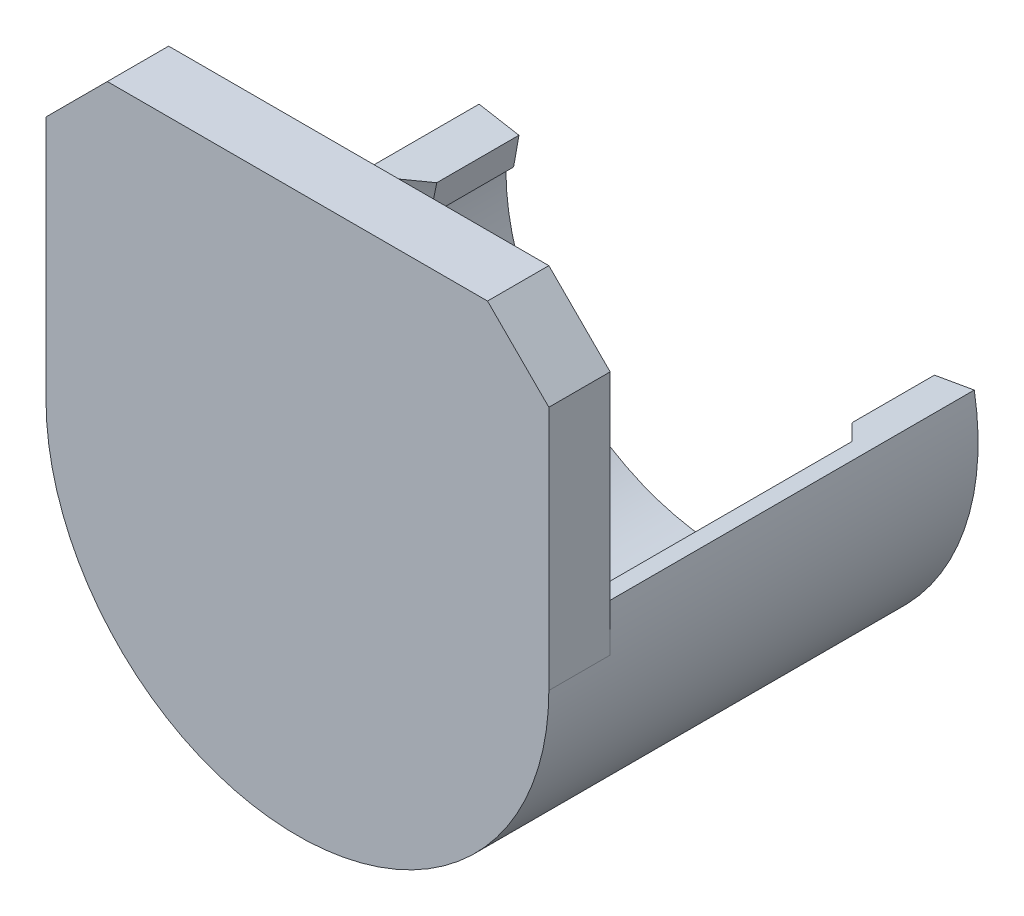
ISO-10303-21;
HEADER;
FILE_DESCRIPTION(('STEP AP214'),'2;1');
FILE_NAME('part.step','',(''),(''),'','','');
FILE_SCHEMA(('AUTOMOTIVE_DESIGN { 1 0 10303 214 1 1 1 1 }'));
ENDSEC;
DATA;
#1=APPLICATION_CONTEXT('core data for automotive mechanical design processes');
#2=APPLICATION_PROTOCOL_DEFINITION('international standard','automotive_design',2000,#1);
#3=PRODUCT_CONTEXT('',#1,'mechanical');
#4=PRODUCT('Part','Part','',(#3));
#5=PRODUCT_RELATED_PRODUCT_CATEGORY('part','',(#4));
#6=PRODUCT_DEFINITION_FORMATION('','',#4);
#7=PRODUCT_DEFINITION_CONTEXT('part definition',#1,'design');
#8=PRODUCT_DEFINITION('design','',#6,#7);
#9=PRODUCT_DEFINITION_SHAPE('','',#8);
#10=(LENGTH_UNIT() NAMED_UNIT(*) SI_UNIT(.MILLI.,.METRE.));
#11=(NAMED_UNIT(*) PLANE_ANGLE_UNIT() SI_UNIT($,.RADIAN.));
#12=(NAMED_UNIT(*) SI_UNIT($,.STERADIAN.) SOLID_ANGLE_UNIT());
#13=UNCERTAINTY_MEASURE_WITH_UNIT(LENGTH_MEASURE(1.E-05),#10,'distance_accuracy_value','');
#14=(GEOMETRIC_REPRESENTATION_CONTEXT(3) GLOBAL_UNCERTAINTY_ASSIGNED_CONTEXT((#13)) GLOBAL_UNIT_ASSIGNED_CONTEXT((#10,
#11,#12)) REPRESENTATION_CONTEXT('',''));
#15=CARTESIAN_POINT('',(0.,0.,0.));
#16=DIRECTION('',(0.,0.,1.));
#17=DIRECTION('',(1.,0.,0.));
#18=AXIS2_PLACEMENT_3D('',#15,#16,#17);
#19=CARTESIAN_POINT('',(10.7560702783993,1.89658539647825,19.05));
#20=DIRECTION('',(0.984807753012207,0.173648177666934,0.));
#21=DIRECTION('',(-0.173648177666934,0.984807753012208,0.));
#22=AXIS2_PLACEMENT_3D('',#19,#20,#21);
#23=PLANE('',#22);
#24=DIRECTION('',(0.,0.,-1.));
#25=VECTOR('',#24,1.);
#26=CARTESIAN_POINT('',(11.0317367604456,0.333203088571373,19.05));
#27=LINE('',#26,#25);
#28=CARTESIAN_POINT('',(11.0317367604456,0.333203088571373,4.36926765407338));
#29=VERTEX_POINT('',#28);
#30=CARTESIAN_POINT('',(11.0317367604456,0.333203088571373,0.));
#31=VERTEX_POINT('',#30);
#32=EDGE_CURVE('E260',#29,#31,#27,.T.);
#33=ORIENTED_EDGE('',*,*,#32,.F.);
#34=CARTESIAN_POINT('',(11.0317367604456,0.333203088571373,4.36926765407338));
#35=CARTESIAN_POINT('',(11.0067573643105,0.474868283737129,4.34856687302384));
#36=CARTESIAN_POINT('',(10.9817087452963,0.616926061359059,4.3305819865409));
#37=CARTESIAN_POINT('',(10.9315450401648,0.901418570275759,4.30021100365753));
#38=CARTESIAN_POINT('',(10.9064300966001,1.04385249311502,4.2878170878302));
#39=CARTESIAN_POINT('',(10.8604560572541,1.30458422663245,4.27037533049476));
#40=CARTESIAN_POINT('',(10.8396071360627,1.42282433434397,4.26443120353665));
#41=CARTESIAN_POINT('',(10.7978623891178,1.65957055875689,4.25648894768613));
#42=CARTESIAN_POINT('',(10.7769665370146,1.77807682489528,4.25449541758792));
#43=CARTESIAN_POINT('',(10.7560702783993,1.89658539647825,4.25450000000002));
#44=B_SPLINE_CURVE_WITH_KNOTS('',3,(#34,#35,#36,#37,#38,#39,#40,#41,#42,#43),.UNSPECIFIED.,.F.,
.F.,(4,2,2,2,4),(0.,0.435984229437677,0.871356794531492,1.23192681347748,1.59291631727818),.UNSPECIFIED.);
#45=CARTESIAN_POINT('',(10.7560702783993,1.89658539647825,4.25450000000002));
#46=VERTEX_POINT('',#45);
#47=EDGE_CURVE('E267',#29,#46,#44,.T.);
#48=ORIENTED_EDGE('',*,*,#47,.T.);
#49=DIRECTION('',(0.,0.,-1.));
#50=VECTOR('',#49,1.);
#51=CARTESIAN_POINT('',(10.7560702783993,1.89658539647825,19.05));
#52=LINE('',#51,#50);
#53=CARTESIAN_POINT('',(10.7560702783993,1.89658539647825,0.));
#54=VERTEX_POINT('',#53);
#55=EDGE_CURVE('E224',#46,#54,#52,.T.);
#56=ORIENTED_EDGE('',*,*,#55,.T.);
#57=DIRECTION('',(0.173648177666934,-0.984807753012207,0.));
#58=VECTOR('',#57,1.);
#59=CARTESIAN_POINT('',(10.7560702783993,1.89658539647825,0.));
#60=LINE('',#59,#58);
#61=EDGE_CURVE('E214',#54,#31,#60,.T.);
#62=ORIENTED_EDGE('',*,*,#61,.T.);
#63=EDGE_LOOP('',(#33,#48,#56,#62));
#64=FACE_BOUND('',#63,.T.);
#65=ADVANCED_FACE('F39',(#64),#23,.F.);
#66=CARTESIAN_POINT('',(11.0317367604456,0.333203088571373,19.05));
#67=DIRECTION('',(0.641680062040874,0.766972423219518,0.));
#68=DIRECTION('',(-0.766972423219518,0.641680062040874,0.));
#69=AXIS2_PLACEMENT_3D('',#66,#67,#68);
#70=PLANE('',#69);
#71=DIRECTION('',(0.,0.,-1.));
#72=VECTOR('',#71,1.);
#73=CARTESIAN_POINT('',(11.43,0.,19.05));
#74=LINE('',#73,#72);
#75=CARTESIAN_POINT('',(11.43,0.,4.76250000000001));
#76=VERTEX_POINT('',#75);
#77=CARTESIAN_POINT('',(11.43,0.,0.));
#78=VERTEX_POINT('',#77);
#79=EDGE_CURVE('E258',#76,#78,#74,.T.);
#80=ORIENTED_EDGE('',*,*,#79,.F.);
#81=CARTESIAN_POINT('',(11.43,0.,4.76250000000001));
#82=CARTESIAN_POINT('',(11.3639377327988,0.0552703570986266,4.69641907041151));
#83=CARTESIAN_POINT('',(11.2977180016301,0.110672454903276,4.63060924903913));
#84=CARTESIAN_POINT('',(11.1649635885535,0.221740151003241,4.49953180021064));
#85=CARTESIAN_POINT('',(11.0984289065374,0.277405749389076,4.43426417294081));
#86=CARTESIAN_POINT('',(11.0317367604456,0.333203088571374,4.36926765407338));
#87=B_SPLINE_CURVE_WITH_KNOTS('',3,(#81,#82,#83,#84,#85,#86),.UNSPECIFIED.,.F.,.F.,(4,2,4),(0.,
0.325681440116724,0.651362992122073),.UNSPECIFIED.);
#88=EDGE_CURVE('E292',#76,#29,#87,.T.);
#89=ORIENTED_EDGE('',*,*,#88,.T.);
#90=ORIENTED_EDGE('',*,*,#32,.T.);
#91=DIRECTION('',(0.766972423219518,-0.641680062040874,0.));
#92=VECTOR('',#91,1.);
#93=CARTESIAN_POINT('',(11.0317367604456,0.333203088571373,0.));
#94=LINE('',#93,#92);
#95=EDGE_CURVE('E227',#31,#78,#94,.T.);
#96=ORIENTED_EDGE('',*,*,#95,.T.);
#97=EDGE_LOOP('',(#80,#89,#90,#96));
#98=FACE_BOUND('',#97,.T.);
#99=ADVANCED_FACE('F306',(#98),#70,.F.);
#100=CARTESIAN_POINT('',(-11.0317367604456,0.333203088571373,19.05));
#101=DIRECTION('',(-0.641680062040875,0.766972423219518,0.));
#102=DIRECTION('',(-0.766972423219518,-0.641680062040875,0.));
#103=AXIS2_PLACEMENT_3D('',#100,#101,#102);
#104=PLANE('',#103);
#105=DIRECTION('',(0.,0.,-1.));
#106=VECTOR('',#105,1.);
#107=CARTESIAN_POINT('',(-11.0317367604456,0.333203088571373,19.05));
#108=LINE('',#107,#106);
#109=CARTESIAN_POINT('',(-11.0317367604456,0.333203088571373,4.36926765407338));
#110=VERTEX_POINT('',#109);
#111=CARTESIAN_POINT('',(-11.0317367604456,0.333203088571373,0.));
#112=VERTEX_POINT('',#111);
#113=EDGE_CURVE('E254',#110,#112,#108,.T.);
#114=ORIENTED_EDGE('',*,*,#113,.F.);
#115=CARTESIAN_POINT('',(-11.0317367604456,0.333203088571373,4.36926765407338));
#116=CARTESIAN_POINT('',(-11.0984289065374,0.277405749389076,4.43426417294081));
#117=CARTESIAN_POINT('',(-11.1649635885535,0.22174015100324,4.49953180021064));
#118=CARTESIAN_POINT('',(-11.2977180016301,0.110672454903276,4.63060924903913));
#119=CARTESIAN_POINT('',(-11.3639377327988,0.0552703570986273,4.69641907041151));
#120=CARTESIAN_POINT('',(-11.43,0.,4.76250000000001));
#121=B_SPLINE_CURVE_WITH_KNOTS('',3,(#115,#116,#117,#118,#119,#120),.UNSPECIFIED.,.F.,.F.,(4,2,
4),(0.,0.325681552005347,0.651362992122069),.UNSPECIFIED.);
#122=CARTESIAN_POINT('',(-11.43,0.,4.76250000000001));
#123=VERTEX_POINT('',#122);
#124=EDGE_CURVE('E323',#110,#123,#121,.T.);
#125=ORIENTED_EDGE('',*,*,#124,.T.);
#126=DIRECTION('',(0.,0.,-1.));
#127=VECTOR('',#126,1.);
#128=CARTESIAN_POINT('',(-11.43,0.,19.05));
#129=LINE('',#128,#127);
#130=CARTESIAN_POINT('',(-11.43,0.,0.));
#131=VERTEX_POINT('',#130);
#132=EDGE_CURVE('E256',#123,#131,#129,.T.);
#133=ORIENTED_EDGE('',*,*,#132,.T.);
#134=DIRECTION('',(0.766972423219518,0.641680062040875,0.));
#135=VECTOR('',#134,1.);
#136=CARTESIAN_POINT('',(-11.0317367604456,0.333203088571373,0.));
#137=LINE('',#136,#135);
#138=EDGE_CURVE('E233',#131,#112,#137,.T.);
#139=ORIENTED_EDGE('',*,*,#138,.T.);
#140=EDGE_LOOP('',(#114,#125,#133,#139));
#141=FACE_BOUND('',#140,.T.);
#142=ADVANCED_FACE('F310',(#141),#104,.F.);
#143=CARTESIAN_POINT('',(-10.7560702783993,1.89658539647825,19.05));
#144=DIRECTION('',(-0.984807753012207,0.173648177666934,0.));
#145=DIRECTION('',(-0.173648177666934,-0.984807753012208,0.));
#146=AXIS2_PLACEMENT_3D('',#143,#144,#145);
#147=PLANE('',#146);
#148=DIRECTION('',(0.,0.,-1.));
#149=VECTOR('',#148,1.);
#150=CARTESIAN_POINT('',(-10.7560702783993,1.89658539647825,19.05));
#151=LINE('',#150,#149);
#152=CARTESIAN_POINT('',(-10.7560702783993,1.89658539647825,4.25450000000002));
#153=VERTEX_POINT('',#152);
#154=CARTESIAN_POINT('',(-10.7560702783993,1.89658539647825,0.));
#155=VERTEX_POINT('',#154);
#156=EDGE_CURVE('E252',#153,#155,#151,.T.);
#157=ORIENTED_EDGE('',*,*,#156,.F.);
#158=CARTESIAN_POINT('',(-10.7560702783993,1.89658539647825,4.25450000000002));
#159=CARTESIAN_POINT('',(-10.7769665370146,1.77807682489528,4.25449541758792));
#160=CARTESIAN_POINT('',(-10.7978623891178,1.65957055875689,4.25648894768613));
#161=CARTESIAN_POINT('',(-10.8396071360627,1.42282433434397,4.26443120353665));
#162=CARTESIAN_POINT('',(-10.8604560572541,1.30458422663245,4.27037533049476));
#163=CARTESIAN_POINT('',(-10.9064300966001,1.04385249311502,4.2878170878302));
#164=CARTESIAN_POINT('',(-10.9315450401648,0.901418570275759,4.30021100365753));
#165=CARTESIAN_POINT('',(-10.9817087452963,0.61692606135906,4.3305819865409));
#166=CARTESIAN_POINT('',(-11.0067573643105,0.47486828373713,4.34856687302384));
#167=CARTESIAN_POINT('',(-11.0317367604456,0.333203088571373,4.36926765407338));
#168=B_SPLINE_CURVE_WITH_KNOTS('',3,(#158,#159,#160,#161,#162,#163,#164,#165,#166,#167),
.UNSPECIFIED.,.F.,.F.,(4,2,2,2,4),(0.,0.360989503800705,0.721559522746688,1.1569320878405,
1.59291631727818),.UNSPECIFIED.);
#169=EDGE_CURVE('E299',#153,#110,#168,.T.);
#170=ORIENTED_EDGE('',*,*,#169,.T.);
#171=ORIENTED_EDGE('',*,*,#113,.T.);
#172=DIRECTION('',(0.173648177666934,0.984807753012207,0.));
#173=VECTOR('',#172,1.);
#174=CARTESIAN_POINT('',(-10.7560702783993,1.89658539647825,0.));
#175=LINE('',#174,#173);
#176=EDGE_CURVE('E236',#112,#155,#175,.T.);
#177=ORIENTED_EDGE('',*,*,#176,.T.);
#178=EDGE_LOOP('',(#157,#170,#171,#177));
#179=FACE_BOUND('',#178,.T.);
#180=ADVANCED_FACE('F319',(#179),#147,.F.);
#181=CARTESIAN_POINT('',(-11.2563526169295,1.98479867073305,19.05));
#182=DIRECTION('',(-0.173648177666934,-0.984807753012207,0.));
#183=DIRECTION('',(0.984807753012207,-0.173648177666934,0.));
#184=AXIS2_PLACEMENT_3D('',#181,#182,#183);
#185=PLANE('',#184);
#186=DIRECTION('',(-0.984807753012208,0.173648177666932,0.));
#187=VECTOR('',#186,1.);
#188=CARTESIAN_POINT('',(-11.2563526169295,1.98479867073305,19.05));
#189=LINE('',#188,#187);
#190=CARTESIAN_POINT('',(-11.7774800528985,2.07668749808181,19.05));
#191=VERTEX_POINT('',#190);
#192=CARTESIAN_POINT('',(-12.8197349248364,2.26046515277931,19.05));
#193=VERTEX_POINT('',#192);
#194=EDGE_CURVE('E189',#191,#193,#189,.T.);
#195=ORIENTED_EDGE('',*,*,#194,.F.);
#196=DIRECTION('',(0.,0.,-1.));
#197=VECTOR('',#196,1.);
#198=CARTESIAN_POINT('',(-11.7774800528985,2.07668749808181,19.05));
#199=LINE('',#198,#197);
#200=CARTESIAN_POINT('',(-11.7774800528985,2.07668749808181,5.29166666666669));
#201=VERTEX_POINT('',#200);
#202=EDGE_CURVE('E342',#191,#201,#199,.T.);
#203=ORIENTED_EDGE('',*,*,#202,.T.);
#204=DIRECTION('',(0.696364240320023,-0.122787803968976,-0.707106781186543));
#205=VECTOR('',#204,1.);
#206=CARTESIAN_POINT('',(0.,0.,-6.66749999999984));
#207=LINE('',#206,#205);
#208=EDGE_CURVE('E330',#201,#153,#207,.T.);
#209=ORIENTED_EDGE('',*,*,#208,.T.);
#210=ORIENTED_EDGE('',*,*,#156,.T.);
#211=DIRECTION('',(-0.984807753012207,0.173648177666934,0.));
#212=VECTOR('',#211,1.);
#213=CARTESIAN_POINT('',(-11.2563526169295,1.98479867073305,0.));
#214=LINE('',#213,#212);
#215=CARTESIAN_POINT('',(-12.8197349248364,2.26046515277931,0.));
#216=VERTEX_POINT('',#215);
#217=EDGE_CURVE('E239',#155,#216,#214,.T.);
#218=ORIENTED_EDGE('',*,*,#217,.T.);
#219=DIRECTION('',(0.,0.,-1.));
#220=VECTOR('',#219,1.);
#221=CARTESIAN_POINT('',(-12.8197349248364,2.26046515277931,19.05));
#222=LINE('',#221,#220);
#223=EDGE_CURVE('E250',#193,#216,#222,.T.);
#224=ORIENTED_EDGE('',*,*,#223,.F.);
#225=EDGE_LOOP('',(#195,#203,#209,#210,#218,#224));
#226=FACE_BOUND('',#225,.T.);
#227=ADVANCED_FACE('F409',(#226),#185,.F.);
#228=CARTESIAN_POINT('',(11.2563526169295,1.98479867073305,19.05));
#229=DIRECTION('',(0.173648177666931,-0.984807753012208,0.));
#230=DIRECTION('',(0.984807753012208,0.173648177666931,0.));
#231=AXIS2_PLACEMENT_3D('',#228,#229,#230);
#232=PLANE('',#231);
#233=DIRECTION('',(0.696364240320023,0.122787803968974,0.707106781186543));
#234=VECTOR('',#233,1.);
#235=CARTESIAN_POINT('',(0.,0.,-6.66749999999984));
#236=LINE('',#235,#234);
#237=CARTESIAN_POINT('',(11.7774800528985,2.0766874980818,5.29166666666668));
#238=VERTEX_POINT('',#237);
#239=EDGE_CURVE('E276',#46,#238,#236,.T.);
#240=ORIENTED_EDGE('',*,*,#239,.T.);
#241=DIRECTION('',(0.,0.,1.));
#242=VECTOR('',#241,1.);
#243=CARTESIAN_POINT('',(11.7774800528985,2.0766874980818,19.05));
#244=LINE('',#243,#242);
#245=CARTESIAN_POINT('',(11.7774800528985,2.07668749808181,19.05));
#246=VERTEX_POINT('',#245);
#247=EDGE_CURVE('E340',#238,#246,#244,.T.);
#248=ORIENTED_EDGE('',*,*,#247,.T.);
#249=DIRECTION('',(-0.984807753012207,-0.173648177666934,0.));
#250=VECTOR('',#249,1.);
#251=CARTESIAN_POINT('',(11.2563526169295,1.98479867073305,19.05));
#252=LINE('',#251,#250);
#253=CARTESIAN_POINT('',(12.8197349248364,2.26046515277931,19.05));
#254=VERTEX_POINT('',#253);
#255=EDGE_CURVE('E221',#254,#246,#252,.T.);
#256=ORIENTED_EDGE('',*,*,#255,.F.);
#257=DIRECTION('',(0.,0.,-1.));
#258=VECTOR('',#257,1.);
#259=CARTESIAN_POINT('',(12.8197349248364,2.26046515277931,19.05));
#260=LINE('',#259,#258);
#261=CARTESIAN_POINT('',(12.8197349248364,2.26046515277931,0.));
#262=VERTEX_POINT('',#261);
#263=EDGE_CURVE('E247',#254,#262,#260,.T.);
#264=ORIENTED_EDGE('',*,*,#263,.T.);
#265=DIRECTION('',(-0.984807753012208,-0.173648177666931,0.));
#266=VECTOR('',#265,1.);
#267=CARTESIAN_POINT('',(11.2563526169295,1.98479867073305,0.));
#268=LINE('',#267,#266);
#269=EDGE_CURVE('E218',#262,#54,#268,.T.);
#270=ORIENTED_EDGE('',*,*,#269,.T.);
#271=ORIENTED_EDGE('',*,*,#55,.F.);
#272=EDGE_LOOP('',(#240,#248,#256,#264,#270,#271));
#273=FACE_BOUND('',#272,.T.);
#274=ADVANCED_FACE('F315',(#273),#232,.F.);
#275=CARTESIAN_POINT('',(0.,0.,19.05));
#276=DIRECTION('',(0.,0.,-1.));
#277=DIRECTION('',(-1.,0.,0.));
#278=AXIS2_PLACEMENT_3D('',#275,#276,#277);
#279=CYLINDRICAL_SURFACE('',#278,11.43);
#280=CARTESIAN_POINT('',(0.,0.,19.05));
#281=DIRECTION('',(0.,0.,-1.));
#282=DIRECTION('',(1.,0.,0.));
#283=AXIS2_PLACEMENT_3D('',#280,#281,#282);
#284=CIRCLE('',#283,11.43);
#285=CARTESIAN_POINT('',(11.3378107269936,1.44877462666509,19.05));
#286=VERTEX_POINT('',#285);
#287=CARTESIAN_POINT('',(-11.3378107269936,1.44877462666509,19.05));
#288=VERTEX_POINT('',#287);
#289=EDGE_CURVE('E215',#286,#288,#284,.T.);
#290=ORIENTED_EDGE('',*,*,#289,.F.);
#291=DIRECTION('',(0.,0.,-1.));
#292=VECTOR('',#291,1.);
#293=CARTESIAN_POINT('',(11.3378107269936,1.44877462666509,19.05));
#294=LINE('',#293,#292);
#295=CARTESIAN_POINT('',(11.3378107269936,1.44877462666509,4.76250000000001));
#296=VERTEX_POINT('',#295);
#297=EDGE_CURVE('E337',#286,#296,#294,.T.);
#298=ORIENTED_EDGE('',*,*,#297,.T.);
#299=CARTESIAN_POINT('',(0.,0.,4.76250000000001));
#300=DIRECTION('',(0.,0.,1.));
#301=DIRECTION('',(1.,0.,0.));
#302=AXIS2_PLACEMENT_3D('',#299,#300,#301);
#303=CIRCLE('',#302,11.43);
#304=EDGE_CURVE('E265',#296,#76,#303,.F.);
#305=ORIENTED_EDGE('',*,*,#304,.T.);
#306=ORIENTED_EDGE('',*,*,#79,.T.);
#307=CARTESIAN_POINT('',(0.,0.,0.));
#308=DIRECTION('',(0.,0.,-1.));
#309=DIRECTION('',(1.,0.,0.));
#310=AXIS2_PLACEMENT_3D('',#307,#308,#309);
#311=CIRCLE('',#310,11.43);
#312=EDGE_CURVE('E230',#78,#131,#311,.T.);
#313=ORIENTED_EDGE('',*,*,#312,.T.);
#314=ORIENTED_EDGE('',*,*,#132,.F.);
#315=CARTESIAN_POINT('',(0.,0.,4.76250000000001));
#316=DIRECTION('',(0.,0.,1.));
#317=DIRECTION('',(1.,0.,0.));
#318=AXIS2_PLACEMENT_3D('',#315,#316,#317);
#319=CIRCLE('',#318,11.43);
#320=CARTESIAN_POINT('',(-11.3378107269936,1.44877462666509,4.76250000000001));
#321=VERTEX_POINT('',#320);
#322=EDGE_CURVE('E262',#123,#321,#319,.F.);
#323=ORIENTED_EDGE('',*,*,#322,.T.);
#324=DIRECTION('',(0.,0.,-1.));
#325=VECTOR('',#324,1.);
#326=CARTESIAN_POINT('',(-11.3378107269936,1.44877462666509,19.05));
#327=LINE('',#326,#325);
#328=EDGE_CURVE('E333',#321,#288,#327,.F.);
#329=ORIENTED_EDGE('',*,*,#328,.T.);
#330=EDGE_LOOP('',(#290,#298,#305,#306,#313,#314,#323,#329));
#331=FACE_BOUND('',#330,.T.);
#332=ADVANCED_FACE('F312',(#331),#279,.F.);
#333=CARTESIAN_POINT('',(0.,0.,19.05));
#334=DIRECTION('',(0.,0.,-1.));
#335=DIRECTION('',(-1.,0.,0.));
#336=AXIS2_PLACEMENT_3D('',#333,#334,#335);
#337=CYLINDRICAL_SURFACE('',#336,13.0175);
#338=CARTESIAN_POINT('',(0.,0.,19.05));
#339=DIRECTION('',(0.,0.,1.));
#340=DIRECTION('',(1.,0.,0.));
#341=AXIS2_PLACEMENT_3D('',#338,#339,#340);
#342=CIRCLE('',#341,13.0175);
#343=CARTESIAN_POINT('',(13.0175,0.,19.05));
#344=VERTEX_POINT('',#343);
#345=EDGE_CURVE('E192',#344,#254,#342,.T.);
#346=ORIENTED_EDGE('',*,*,#345,.F.);
#347=DIRECTION('',(0.,0.,1.));
#348=VECTOR('',#347,1.);
#349=CARTESIAN_POINT('',(13.0175,0.,-11.4432262969991));
#350=LINE('',#349,#348);
#351=CARTESIAN_POINT('',(13.0175,0.,22.225));
#352=VERTEX_POINT('',#351);
#353=EDGE_CURVE('E182',#344,#352,#350,.T.);
#354=ORIENTED_EDGE('',*,*,#353,.T.);
#355=CARTESIAN_POINT('',(0.,0.,22.225));
#356=DIRECTION('',(0.,0.,1.));
#357=DIRECTION('',(1.,0.,0.));
#358=AXIS2_PLACEMENT_3D('',#355,#356,#357);
#359=CIRCLE('',#358,13.0175);
#360=CARTESIAN_POINT('',(-13.0175,0.,22.225));
#361=VERTEX_POINT('',#360);
#362=EDGE_CURVE('E180',#361,#352,#359,.T.);
#363=ORIENTED_EDGE('',*,*,#362,.F.);
#364=DIRECTION('',(0.,0.,1.));
#365=VECTOR('',#364,1.);
#366=CARTESIAN_POINT('',(-13.0175,0.,-11.4432262969991));
#367=LINE('',#366,#365);
#368=CARTESIAN_POINT('',(-13.0175,0.,19.05));
#369=VERTEX_POINT('',#368);
#370=EDGE_CURVE('E172',#369,#361,#367,.T.);
#371=ORIENTED_EDGE('',*,*,#370,.F.);
#372=EDGE_CURVE('E177',#193,#369,#342,.T.);
#373=ORIENTED_EDGE('',*,*,#372,.F.);
#374=ORIENTED_EDGE('',*,*,#223,.T.);
#375=CARTESIAN_POINT('',(0.,0.,0.));
#376=DIRECTION('',(0.,0.,1.));
#377=DIRECTION('',(1.,0.,0.));
#378=AXIS2_PLACEMENT_3D('',#375,#376,#377);
#379=CIRCLE('',#378,13.0175);
#380=EDGE_CURVE('E241',#216,#262,#379,.T.);
#381=ORIENTED_EDGE('',*,*,#380,.T.);
#382=ORIENTED_EDGE('',*,*,#263,.F.);
#383=EDGE_LOOP('',(#346,#354,#363,#371,#373,#374,#381,#382));
#384=FACE_BOUND('',#383,.T.);
#385=ADVANCED_FACE('F175',(#384),#337,.T.);
#386=CARTESIAN_POINT('',(0.,0.,0.));
#387=DIRECTION('',(0.,0.,1.));
#388=DIRECTION('',(1.,0.,0.));
#389=AXIS2_PLACEMENT_3D('',#386,#387,#388);
#390=PLANE('',#389);
#391=ORIENTED_EDGE('',*,*,#61,.F.);
#392=ORIENTED_EDGE('',*,*,#269,.F.);
#393=ORIENTED_EDGE('',*,*,#380,.F.);
#394=ORIENTED_EDGE('',*,*,#217,.F.);
#395=ORIENTED_EDGE('',*,*,#176,.F.);
#396=ORIENTED_EDGE('',*,*,#138,.F.);
#397=ORIENTED_EDGE('',*,*,#312,.F.);
#398=ORIENTED_EDGE('',*,*,#95,.F.);
#399=EDGE_LOOP('',(#391,#392,#393,#394,#395,#396,#397,#398));
#400=FACE_BOUND('',#399,.T.);
#401=ADVANCED_FACE('F423',(#400),#390,.F.);
#402=CARTESIAN_POINT('',(0.,0.,19.05));
#403=DIRECTION('',(0.,0.,1.));
#404=DIRECTION('',(1.,0.,0.));
#405=AXIS2_PLACEMENT_3D('',#402,#403,#404);
#406=PLANE('',#405);
#407=DIRECTION('',(0.,1.,0.));
#408=VECTOR('',#407,1.);
#409=CARTESIAN_POINT('',(-13.0175,0.,19.05));
#410=LINE('',#409,#408);
#411=CARTESIAN_POINT('',(-13.0175,12.7,19.05));
#412=VERTEX_POINT('',#411);
#413=EDGE_CURVE('E186',#369,#412,#410,.T.);
#414=ORIENTED_EDGE('',*,*,#413,.T.);
#415=DIRECTION('',(-0.707106781186546,-0.70710678118655,0.));
#416=VECTOR('',#415,1.);
#417=CARTESIAN_POINT('',(-9.8425,15.875,19.05));
#418=LINE('',#417,#416);
#419=CARTESIAN_POINT('',(-9.8425,15.875,19.05));
#420=VERTEX_POINT('',#419);
#421=EDGE_CURVE('E47',#412,#420,#418,.F.);
#422=ORIENTED_EDGE('',*,*,#421,.T.);
#423=DIRECTION('',(1.,0.,0.));
#424=VECTOR('',#423,1.);
#425=CARTESIAN_POINT('',(13.0175,15.875,19.05));
#426=LINE('',#425,#424);
#427=CARTESIAN_POINT('',(9.84249999999999,15.875,19.05));
#428=VERTEX_POINT('',#427);
#429=EDGE_CURVE('E193',#420,#428,#426,.T.);
#430=ORIENTED_EDGE('',*,*,#429,.T.);
#431=DIRECTION('',(-0.707106781186549,0.707106781186546,0.));
#432=VECTOR('',#431,1.);
#433=CARTESIAN_POINT('',(13.0175,12.7,19.05));
#434=LINE('',#433,#432);
#435=CARTESIAN_POINT('',(13.0175,12.7,19.05));
#436=VERTEX_POINT('',#435);
#437=EDGE_CURVE('E54',#428,#436,#434,.F.);
#438=ORIENTED_EDGE('',*,*,#437,.T.);
#439=DIRECTION('',(0.,-1.,0.));
#440=VECTOR('',#439,1.);
#441=CARTESIAN_POINT('',(13.0175,0.,19.05));
#442=LINE('',#441,#440);
#443=EDGE_CURVE('E197',#436,#344,#442,.T.);
#444=ORIENTED_EDGE('',*,*,#443,.T.);
#445=ORIENTED_EDGE('',*,*,#345,.T.);
#446=ORIENTED_EDGE('',*,*,#255,.T.);
#447=DIRECTION('',(0.573576436351047,0.819152044288991,0.));
#448=VECTOR('',#447,1.);
#449=CARTESIAN_POINT('',(6.92708377549009,-4.85039627740836,19.05));
#450=LINE('',#449,#448);
#451=EDGE_CURVE('E352',#246,#286,#450,.F.);
#452=ORIENTED_EDGE('',*,*,#451,.T.);
#453=ORIENTED_EDGE('',*,*,#289,.T.);
#454=DIRECTION('',(-0.573576436351046,0.819152044288992,0.));
#455=VECTOR('',#454,1.);
#456=CARTESIAN_POINT('',(-6.92708377549012,-4.85039627740835,19.05));
#457=LINE('',#456,#455);
#458=EDGE_CURVE('E373',#288,#191,#457,.T.);
#459=ORIENTED_EDGE('',*,*,#458,.T.);
#460=ORIENTED_EDGE('',*,*,#194,.T.);
#461=ORIENTED_EDGE('',*,*,#372,.T.);
#462=EDGE_LOOP('',(#414,#422,#430,#438,#444,#445,#446,#452,#453,#459,#460,#461));
#463=FACE_BOUND('',#462,.T.);
#464=ADVANCED_FACE('F185',(#463),#406,.F.);
#465=CARTESIAN_POINT('',(0.,0.,22.225));
#466=DIRECTION('',(0.,0.,1.));
#467=DIRECTION('',(1.,0.,0.));
#468=AXIS2_PLACEMENT_3D('',#465,#466,#467);
#469=PLANE('',#468);
#470=DIRECTION('',(-1.,0.,0.));
#471=VECTOR('',#470,1.);
#472=CARTESIAN_POINT('',(13.0175,15.875,22.225));
#473=LINE('',#472,#471);
#474=CARTESIAN_POINT('',(9.84249999999999,15.875,22.225));
#475=VERTEX_POINT('',#474);
#476=CARTESIAN_POINT('',(-9.8425,15.875,22.225));
#477=VERTEX_POINT('',#476);
#478=EDGE_CURVE('E206',#475,#477,#473,.T.);
#479=ORIENTED_EDGE('',*,*,#478,.T.);
#480=DIRECTION('',(0.707106781186546,0.70710678118655,0.));
#481=VECTOR('',#480,1.);
#482=CARTESIAN_POINT('',(-12.85875,12.85875,22.225));
#483=LINE('',#482,#481);
#484=CARTESIAN_POINT('',(-13.0175,12.7,22.225));
#485=VERTEX_POINT('',#484);
#486=EDGE_CURVE('E380',#477,#485,#483,.F.);
#487=ORIENTED_EDGE('',*,*,#486,.T.);
#488=DIRECTION('',(0.,-1.,0.));
#489=VECTOR('',#488,1.);
#490=CARTESIAN_POINT('',(-13.0175,0.,22.225));
#491=LINE('',#490,#489);
#492=EDGE_CURVE('E183',#485,#361,#491,.T.);
#493=ORIENTED_EDGE('',*,*,#492,.T.);
#494=ORIENTED_EDGE('',*,*,#362,.T.);
#495=DIRECTION('',(0.,1.,0.));
#496=VECTOR('',#495,1.);
#497=CARTESIAN_POINT('',(13.0175,0.,22.225));
#498=LINE('',#497,#496);
#499=CARTESIAN_POINT('',(13.0175,12.7,22.225));
#500=VERTEX_POINT('',#499);
#501=EDGE_CURVE('E203',#352,#500,#498,.T.);
#502=ORIENTED_EDGE('',*,*,#501,.T.);
#503=DIRECTION('',(0.707106781186549,-0.707106781186546,0.));
#504=VECTOR('',#503,1.);
#505=CARTESIAN_POINT('',(12.85875,12.85875,22.225));
#506=LINE('',#505,#504);
#507=EDGE_CURVE('E378',#500,#475,#506,.F.);
#508=ORIENTED_EDGE('',*,*,#507,.T.);
#509=EDGE_LOOP('',(#479,#487,#493,#494,#502,#508));
#510=FACE_BOUND('',#509,.T.);
#511=ADVANCED_FACE('F285',(#510),#469,.T.);
#512=CARTESIAN_POINT('',(0.,0.,3.175));
#513=DIRECTION('',(0.,0.,1.));
#514=DIRECTION('',(1.,0.,0.));
#515=AXIS2_PLACEMENT_3D('',#512,#513,#514);
#516=CONICAL_SURFACE('',#515,9.84249999999997,0.785398163397455);
#517=ORIENTED_EDGE('',*,*,#88,.F.);
#518=ORIENTED_EDGE('',*,*,#304,.F.);
#519=CARTESIAN_POINT('',(11.3378107269936,1.44877462666509,4.76250000000001));
#520=CARTESIAN_POINT('',(11.3747518080827,1.50153195798931,4.80583047655281));
#521=CARTESIAN_POINT('',(11.4116138028728,1.5541763423734,4.84936564583564));
#522=CARTESIAN_POINT('',(11.4851840534718,1.65924554912188,4.93682446900206));
#523=CARTESIAN_POINT('',(11.5218923144287,1.71167037883839,4.98074810972135));
#524=CARTESIAN_POINT('',(11.5951619399946,1.81631024854512,5.06896580148874));
#525=CARTESIAN_POINT('',(11.6317233049418,1.86852528901823,5.11325985168353));
#526=CARTESIAN_POINT('',(11.7047058169441,1.97275511806139,5.20220228600153));
#527=CARTESIAN_POINT('',(11.7411269592241,2.02476989981179,5.24685068203594));
#528=CARTESIAN_POINT('',(11.7774800528985,2.07668749808181,5.29166666666668));
#529=B_SPLINE_CURVE_WITH_KNOTS('',3,(#519,#520,#521,#522,#523,#524,#525,#526,#527,#528),
.UNSPECIFIED.,.F.,.F.,(4,2,2,2,4),(0.,0.23287187545566,0.46573588949133,0.69859936722795,
0.931470706024126),.UNSPECIFIED.);
#530=EDGE_CURVE('E345',#296,#238,#529,.T.);
#531=ORIENTED_EDGE('',*,*,#530,.T.);
#532=ORIENTED_EDGE('',*,*,#239,.F.);
#533=ORIENTED_EDGE('',*,*,#47,.F.);
#534=EDGE_LOOP('',(#517,#518,#531,#532,#533));
#535=FACE_BOUND('',#534,.T.);
#536=ADVANCED_FACE('F280',(#535),#516,.F.);
#537=CARTESIAN_POINT('',(0.,0.,3.175));
#538=DIRECTION('',(0.,0.,1.));
#539=DIRECTION('',(1.,0.,0.));
#540=AXIS2_PLACEMENT_3D('',#537,#538,#539);
#541=CONICAL_SURFACE('',#540,9.84249999999997,0.785398163397455);
#542=ORIENTED_EDGE('',*,*,#208,.F.);
#543=CARTESIAN_POINT('',(-11.7774800528985,2.07668749808181,5.29166666666669));
#544=CARTESIAN_POINT('',(-11.7411269592241,2.02476989981179,5.24685068203595));
#545=CARTESIAN_POINT('',(-11.7047058169441,1.97275511806139,5.20220228600153));
#546=CARTESIAN_POINT('',(-11.6317233049418,1.86852528901823,5.11325985168354));
#547=CARTESIAN_POINT('',(-11.5951619399946,1.81631024854512,5.06896580148875));
#548=CARTESIAN_POINT('',(-11.5218923144287,1.71167037883839,4.98074810972136));
#549=CARTESIAN_POINT('',(-11.4851840534718,1.65924554912188,4.93682446900206));
#550=CARTESIAN_POINT('',(-11.4116138028728,1.55417634237339,4.84936564583564));
#551=CARTESIAN_POINT('',(-11.3747518080827,1.50153195798931,4.80583047655281));
#552=CARTESIAN_POINT('',(-11.3378107269936,1.44877462666509,4.76250000000001));
#553=B_SPLINE_CURVE_WITH_KNOTS('',3,(#543,#544,#545,#546,#547,#548,#549,#550,#551,#552),
.UNSPECIFIED.,.F.,.F.,(4,2,2,2,4),(0.,0.232871338796181,0.465734816532804,0.698598830568478,
0.931470706024139),.UNSPECIFIED.);
#554=EDGE_CURVE('E366',#201,#321,#553,.T.);
#555=ORIENTED_EDGE('',*,*,#554,.T.);
#556=ORIENTED_EDGE('',*,*,#322,.F.);
#557=ORIENTED_EDGE('',*,*,#124,.F.);
#558=ORIENTED_EDGE('',*,*,#169,.F.);
#559=EDGE_LOOP('',(#542,#555,#556,#557,#558));
#560=FACE_BOUND('',#559,.T.);
#561=ADVANCED_FACE('F284',(#560),#541,.F.);
#562=CARTESIAN_POINT('',(11.3378107269936,1.44877462666509,19.05));
#563=DIRECTION('',(0.819152044288991,-0.573576436351047,0.));
#564=DIRECTION('',(0.,0.,-1.));
#565=AXIS2_PLACEMENT_3D('',#562,#563,#564);
#566=PLANE('',#565);
#567=ORIENTED_EDGE('',*,*,#451,.F.);
#568=ORIENTED_EDGE('',*,*,#247,.F.);
#569=ORIENTED_EDGE('',*,*,#530,.F.);
#570=ORIENTED_EDGE('',*,*,#297,.F.);
#571=EDGE_LOOP('',(#567,#568,#569,#570));
#572=FACE_BOUND('',#571,.T.);
#573=ADVANCED_FACE('F354',(#572),#566,.F.);
#574=CARTESIAN_POINT('',(-11.3378107269936,1.44877462666508,19.05));
#575=DIRECTION('',(0.819152044288992,0.573576436351046,0.));
#576=DIRECTION('',(0.,0.,-1.));
#577=AXIS2_PLACEMENT_3D('',#574,#575,#576);
#578=PLANE('',#577);
#579=ORIENTED_EDGE('',*,*,#554,.F.);
#580=ORIENTED_EDGE('',*,*,#202,.F.);
#581=ORIENTED_EDGE('',*,*,#458,.F.);
#582=ORIENTED_EDGE('',*,*,#328,.F.);
#583=EDGE_LOOP('',(#579,#580,#581,#582));
#584=FACE_BOUND('',#583,.T.);
#585=ADVANCED_FACE('F358',(#584),#578,.T.);
#586=CARTESIAN_POINT('',(13.0175,0.,-11.4432262969991));
#587=DIRECTION('',(1.,0.,0.));
#588=DIRECTION('',(0.,1.,0.));
#589=AXIS2_PLACEMENT_3D('',#586,#587,#588);
#590=PLANE('',#589);
#591=ORIENTED_EDGE('',*,*,#443,.F.);
#592=DIRECTION('',(0.,0.,1.));
#593=VECTOR('',#592,1.);
#594=CARTESIAN_POINT('',(13.0175,12.7,-11.4432262969991));
#595=LINE('',#594,#593);
#596=EDGE_CURVE('E12',#436,#500,#595,.T.);
#597=ORIENTED_EDGE('',*,*,#596,.T.);
#598=ORIENTED_EDGE('',*,*,#501,.F.);
#599=ORIENTED_EDGE('',*,*,#353,.F.);
#600=EDGE_LOOP('',(#591,#597,#598,#599));
#601=FACE_BOUND('',#600,.T.);
#602=ADVANCED_FACE('F362',(#601),#590,.T.);
#603=CARTESIAN_POINT('',(-13.0175,0.,-11.4432262969991));
#604=DIRECTION('',(-1.,0.,0.));
#605=DIRECTION('',(0.,-1.,0.));
#606=AXIS2_PLACEMENT_3D('',#603,#604,#605);
#607=PLANE('',#606);
#608=ORIENTED_EDGE('',*,*,#492,.F.);
#609=DIRECTION('',(0.,0.,-1.));
#610=VECTOR('',#609,1.);
#611=CARTESIAN_POINT('',(-13.0175,12.7,-11.4432262969991));
#612=LINE('',#611,#610);
#613=EDGE_CURVE('E62',#485,#412,#612,.T.);
#614=ORIENTED_EDGE('',*,*,#613,.T.);
#615=ORIENTED_EDGE('',*,*,#413,.F.);
#616=ORIENTED_EDGE('',*,*,#370,.T.);
#617=EDGE_LOOP('',(#608,#614,#615,#616));
#618=FACE_BOUND('',#617,.T.);
#619=ADVANCED_FACE('F195',(#618),#607,.T.);
#620=CARTESIAN_POINT('',(13.0175,15.875,-11.4432262969991));
#621=DIRECTION('',(0.,1.,0.));
#622=DIRECTION('',(0.,0.,1.));
#623=AXIS2_PLACEMENT_3D('',#620,#621,#622);
#624=PLANE('',#623);
#625=ORIENTED_EDGE('',*,*,#429,.F.);
#626=DIRECTION('',(0.,0.,1.));
#627=VECTOR('',#626,1.);
#628=CARTESIAN_POINT('',(-9.8425,15.875,-11.4432262969991));
#629=LINE('',#628,#627);
#630=EDGE_CURVE('E375',#420,#477,#629,.T.);
#631=ORIENTED_EDGE('',*,*,#630,.T.);
#632=ORIENTED_EDGE('',*,*,#478,.F.);
#633=DIRECTION('',(0.,0.,-1.));
#634=VECTOR('',#633,1.);
#635=CARTESIAN_POINT('',(9.84249999999999,15.875,-11.4432262969991));
#636=LINE('',#635,#634);
#637=EDGE_CURVE('E372',#475,#428,#636,.T.);
#638=ORIENTED_EDGE('',*,*,#637,.T.);
#639=EDGE_LOOP('',(#625,#631,#632,#638));
#640=FACE_BOUND('',#639,.T.);
#641=ADVANCED_FACE('F387',(#640),#624,.T.);
#642=CARTESIAN_POINT('',(-9.8425,15.875,-11.4432262969991));
#643=DIRECTION('',(0.70710678118655,-0.707106781186546,0.));
#644=DIRECTION('',(0.,0.,1.));
#645=AXIS2_PLACEMENT_3D('',#642,#643,#644);
#646=PLANE('',#645);
#647=ORIENTED_EDGE('',*,*,#421,.F.);
#648=ORIENTED_EDGE('',*,*,#613,.F.);
#649=ORIENTED_EDGE('',*,*,#486,.F.);
#650=ORIENTED_EDGE('',*,*,#630,.F.);
#651=EDGE_LOOP('',(#647,#648,#649,#650));
#652=FACE_BOUND('',#651,.T.);
#653=ADVANCED_FACE('F364',(#652),#646,.F.);
#654=CARTESIAN_POINT('',(13.0175,12.7,-11.4432262969991));
#655=DIRECTION('',(-0.707106781186546,-0.707106781186549,0.));
#656=DIRECTION('',(0.,0.,1.));
#657=AXIS2_PLACEMENT_3D('',#654,#655,#656);
#658=PLANE('',#657);
#659=ORIENTED_EDGE('',*,*,#437,.F.);
#660=ORIENTED_EDGE('',*,*,#637,.F.);
#661=ORIENTED_EDGE('',*,*,#507,.F.);
#662=ORIENTED_EDGE('',*,*,#596,.F.);
#663=EDGE_LOOP('',(#659,#660,#661,#662));
#664=FACE_BOUND('',#663,.T.);
#665=ADVANCED_FACE('F41',(#664),#658,.F.);
#666=CLOSED_SHELL('',(#65,#99,#142,#180,#227,#274,#332,#385,#401,#464,#511,#536,#561,#573,#585,
#602,#619,#641,#653,#665));
#667=MANIFOLD_SOLID_BREP('B2',#666);
#668=ADVANCED_BREP_SHAPE_REPRESENTATION('',(#18,#667),#14);
#669=SHAPE_DEFINITION_REPRESENTATION(#9,#668);
ENDSEC;
END-ISO-10303-21;
